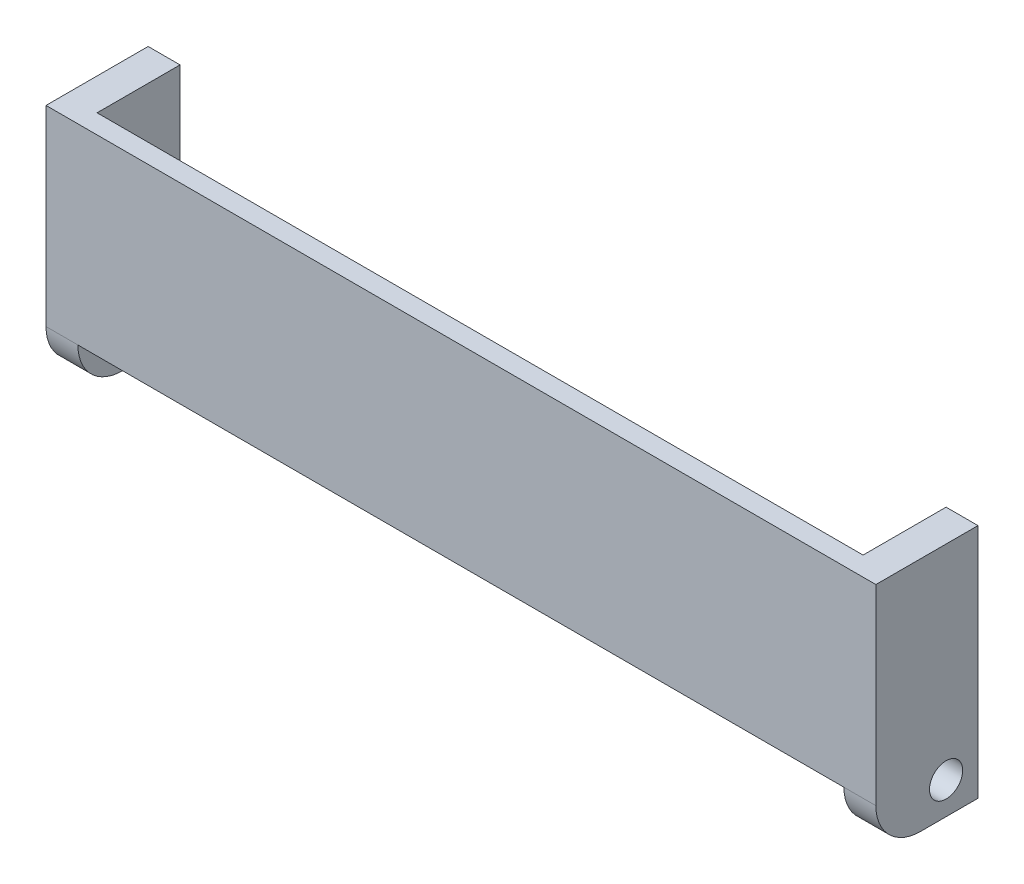
ISO-10303-21;
HEADER;
FILE_DESCRIPTION(('STEP AP214'),'2;1');
FILE_NAME('part.step','',(''),(''),'','','');
FILE_SCHEMA(('AUTOMOTIVE_DESIGN { 1 0 10303 214 1 1 1 1 }'));
ENDSEC;
DATA;
#1=APPLICATION_CONTEXT('core data for automotive mechanical design processes');
#2=APPLICATION_PROTOCOL_DEFINITION('international standard','automotive_design',2000,#1);
#3=PRODUCT_CONTEXT('',#1,'mechanical');
#4=PRODUCT('Part','Part','',(#3));
#5=PRODUCT_RELATED_PRODUCT_CATEGORY('part','',(#4));
#6=PRODUCT_DEFINITION_FORMATION('','',#4);
#7=PRODUCT_DEFINITION_CONTEXT('part definition',#1,'design');
#8=PRODUCT_DEFINITION('design','',#6,#7);
#9=PRODUCT_DEFINITION_SHAPE('','',#8);
#10=(LENGTH_UNIT() NAMED_UNIT(*) SI_UNIT(.MILLI.,.METRE.));
#11=(NAMED_UNIT(*) PLANE_ANGLE_UNIT() SI_UNIT($,.RADIAN.));
#12=(NAMED_UNIT(*) SI_UNIT($,.STERADIAN.) SOLID_ANGLE_UNIT());
#13=UNCERTAINTY_MEASURE_WITH_UNIT(LENGTH_MEASURE(1.E-05),#10,'distance_accuracy_value','');
#14=(GEOMETRIC_REPRESENTATION_CONTEXT(3) GLOBAL_UNCERTAINTY_ASSIGNED_CONTEXT((#13)) GLOBAL_UNIT_ASSIGNED_CONTEXT((#10,
#11,#12)) REPRESENTATION_CONTEXT('',''));
#15=CARTESIAN_POINT('',(0.,0.,0.));
#16=DIRECTION('',(0.,0.,1.));
#17=DIRECTION('',(1.,0.,0.));
#18=AXIS2_PLACEMENT_3D('',#15,#16,#17);
#19=CARTESIAN_POINT('',(0.,0.,10.));
#20=DIRECTION('',(1.,0.,0.));
#21=DIRECTION('',(0.,1.,0.));
#22=AXIS2_PLACEMENT_3D('',#19,#20,#21);
#23=PLANE('',#22);
#24=CARTESIAN_POINT('',(0.,-35.,5.));
#25=DIRECTION('',(1.,0.,0.));
#26=DIRECTION('',(0.,1.,0.));
#27=AXIS2_PLACEMENT_3D('',#24,#25,#26);
#28=CIRCLE('',#27,2.6);
#29=CARTESIAN_POINT('',(0.,-32.4,5.));
#30=VERTEX_POINT('',#29);
#31=EDGE_CURVE('E185',#30,#30,#28,.T.);
#32=ORIENTED_EDGE('',*,*,#31,.T.);
#33=EDGE_LOOP('',(#32));
#34=FACE_BOUND('',#33,.T.);
#35=DIRECTION('',(0.,0.,1.));
#36=VECTOR('',#35,1.);
#37=CARTESIAN_POINT('',(0.,-3.00000000000002,10.));
#38=LINE('',#37,#36);
#39=CARTESIAN_POINT('',(0.,-3.00000000000002,0.));
#40=VERTEX_POINT('',#39);
#41=CARTESIAN_POINT('',(0.,-3.00000000000002,13.));
#42=VERTEX_POINT('',#41);
#43=EDGE_CURVE('E247',#40,#42,#38,.T.);
#44=ORIENTED_EDGE('',*,*,#43,.F.);
#45=DIRECTION('',(0.,-1.,0.));
#46=VECTOR('',#45,1.);
#47=CARTESIAN_POINT('',(0.,0.,0.));
#48=LINE('',#47,#46);
#49=CARTESIAN_POINT('',(0.,-40.,0.));
#50=VERTEX_POINT('',#49);
#51=EDGE_CURVE('E188',#40,#50,#48,.T.);
#52=ORIENTED_EDGE('',*,*,#51,.T.);
#53=DIRECTION('',(0.,0.,-1.));
#54=VECTOR('',#53,1.);
#55=CARTESIAN_POINT('',(0.,-40.,10.));
#56=LINE('',#55,#54);
#57=CARTESIAN_POINT('',(0.,-40.,9.));
#58=VERTEX_POINT('',#57);
#59=EDGE_CURVE('E198',#58,#50,#56,.T.);
#60=ORIENTED_EDGE('',*,*,#59,.F.);
#61=CARTESIAN_POINT('',(0.,-33.,9.));
#62=DIRECTION('',(1.,0.,0.));
#63=DIRECTION('',(0.,1.,0.));
#64=AXIS2_PLACEMENT_3D('',#61,#62,#63);
#65=CIRCLE('',#64,7.);
#66=CARTESIAN_POINT('',(0.,-33.,16.));
#67=VERTEX_POINT('',#66);
#68=EDGE_CURVE('E11',#58,#67,#65,.F.);
#69=ORIENTED_EDGE('',*,*,#68,.T.);
#70=DIRECTION('',(0.,0.,1.));
#71=VECTOR('',#70,1.);
#72=CARTESIAN_POINT('',(0.,-33.,16.));
#73=LINE('',#72,#71);
#74=CARTESIAN_POINT('',(0.,-33.,13.));
#75=VERTEX_POINT('',#74);
#76=EDGE_CURVE('E167',#75,#67,#73,.T.);
#77=ORIENTED_EDGE('',*,*,#76,.F.);
#78=DIRECTION('',(0.,-1.,0.));
#79=VECTOR('',#78,1.);
#80=CARTESIAN_POINT('',(0.,-33.,13.));
#81=LINE('',#80,#79);
#82=EDGE_CURVE('E163',#42,#75,#81,.T.);
#83=ORIENTED_EDGE('',*,*,#82,.F.);
#84=EDGE_LOOP('',(#44,#52,#60,#69,#77,#83));
#85=FACE_BOUND('',#84,.T.);
#86=ADVANCED_FACE('F37',(#34,#85),#23,.F.);
#87=CARTESIAN_POINT('',(5.,0.,10.));
#88=DIRECTION('',(-1.,0.,0.));
#89=DIRECTION('',(0.,-1.,0.));
#90=AXIS2_PLACEMENT_3D('',#87,#88,#89);
#91=PLANE('',#90);
#92=CARTESIAN_POINT('',(5.,-35.,5.));
#93=DIRECTION('',(1.,0.,0.));
#94=DIRECTION('',(0.,1.,0.));
#95=AXIS2_PLACEMENT_3D('',#92,#93,#94);
#96=CIRCLE('',#95,2.6);
#97=CARTESIAN_POINT('',(5.,-32.4,5.));
#98=VERTEX_POINT('',#97);
#99=EDGE_CURVE('E182',#98,#98,#96,.T.);
#100=ORIENTED_EDGE('',*,*,#99,.F.);
#101=EDGE_LOOP('',(#100));
#102=FACE_BOUND('',#101,.T.);
#103=DIRECTION('',(0.,0.,-1.));
#104=VECTOR('',#103,1.);
#105=CARTESIAN_POINT('',(5.00000000000001,-3.00000000000002,20.));
#106=LINE('',#105,#104);
#107=CARTESIAN_POINT('',(5.00000000000001,-3.00000000000002,16.));
#108=VERTEX_POINT('',#107);
#109=CARTESIAN_POINT('',(5.00000000000001,-3.00000000000002,0.));
#110=VERTEX_POINT('',#109);
#111=EDGE_CURVE('E125',#108,#110,#106,.T.);
#112=ORIENTED_EDGE('',*,*,#111,.F.);
#113=DIRECTION('',(0.,1.,0.));
#114=VECTOR('',#113,1.);
#115=CARTESIAN_POINT('',(5.00000000000001,0.,16.));
#116=LINE('',#115,#114);
#117=CARTESIAN_POINT('',(5.00000000000001,-33.,16.));
#118=VERTEX_POINT('',#117);
#119=EDGE_CURVE('E179',#118,#108,#116,.T.);
#120=ORIENTED_EDGE('',*,*,#119,.F.);
#121=CARTESIAN_POINT('',(5.,-33.,9.));
#122=DIRECTION('',(-1.,0.,0.));
#123=DIRECTION('',(0.,-1.,0.));
#124=AXIS2_PLACEMENT_3D('',#121,#122,#123);
#125=CIRCLE('',#124,7.);
#126=CARTESIAN_POINT('',(5.00000000000001,-40.,9.));
#127=VERTEX_POINT('',#126);
#128=EDGE_CURVE('E203',#118,#127,#125,.F.);
#129=ORIENTED_EDGE('',*,*,#128,.T.);
#130=DIRECTION('',(0.,0.,-1.));
#131=VECTOR('',#130,1.);
#132=CARTESIAN_POINT('',(5.00000000000001,-40.,10.));
#133=LINE('',#132,#131);
#134=CARTESIAN_POINT('',(5.00000000000001,-40.,0.));
#135=VERTEX_POINT('',#134);
#136=EDGE_CURVE('E196',#127,#135,#133,.T.);
#137=ORIENTED_EDGE('',*,*,#136,.T.);
#138=DIRECTION('',(0.,1.,0.));
#139=VECTOR('',#138,1.);
#140=CARTESIAN_POINT('',(5.,0.,0.));
#141=LINE('',#140,#139);
#142=EDGE_CURVE('E193',#135,#110,#141,.T.);
#143=ORIENTED_EDGE('',*,*,#142,.T.);
#144=EDGE_LOOP('',(#112,#120,#129,#137,#143));
#145=FACE_BOUND('',#144,.T.);
#146=ADVANCED_FACE('F207',(#102,#145),#91,.F.);
#147=CARTESIAN_POINT('',(0.,0.,0.));
#148=DIRECTION('',(0.,0.,1.));
#149=DIRECTION('',(1.,0.,0.));
#150=AXIS2_PLACEMENT_3D('',#147,#148,#149);
#151=PLANE('',#150);
#152=DIRECTION('',(1.,0.,0.));
#153=VECTOR('',#152,1.);
#154=CARTESIAN_POINT('',(-125.,-3.00000000000002,0.));
#155=LINE('',#154,#153);
#156=EDGE_CURVE('E126',#40,#110,#155,.T.);
#157=ORIENTED_EDGE('',*,*,#156,.T.);
#158=ORIENTED_EDGE('',*,*,#142,.F.);
#159=DIRECTION('',(1.,0.,0.));
#160=VECTOR('',#159,1.);
#161=CARTESIAN_POINT('',(0.,-40.,0.));
#162=LINE('',#161,#160);
#163=EDGE_CURVE('E190',#50,#135,#162,.T.);
#164=ORIENTED_EDGE('',*,*,#163,.F.);
#165=ORIENTED_EDGE('',*,*,#51,.F.);
#166=EDGE_LOOP('',(#157,#158,#164,#165));
#167=FACE_BOUND('',#166,.T.);
#168=ADVANCED_FACE('F221',(#167),#151,.F.);
#169=CARTESIAN_POINT('',(0.,0.,16.));
#170=DIRECTION('',(0.,0.,1.));
#171=DIRECTION('',(1.,0.,0.));
#172=AXIS2_PLACEMENT_3D('',#169,#170,#171);
#173=PLANE('',#172);
#174=ORIENTED_EDGE('',*,*,#119,.T.);
#175=DIRECTION('',(-1.,0.,0.));
#176=VECTOR('',#175,1.);
#177=CARTESIAN_POINT('',(0.,-3.00000000000002,16.));
#178=LINE('',#177,#176);
#179=CARTESIAN_POINT('',(-125.,-3.00000000000002,16.));
#180=VERTEX_POINT('',#179);
#181=EDGE_CURVE('E225',#108,#180,#178,.T.);
#182=ORIENTED_EDGE('',*,*,#181,.T.);
#183=DIRECTION('',(0.,1.,0.));
#184=VECTOR('',#183,1.);
#185=CARTESIAN_POINT('',(-125.,0.,16.));
#186=LINE('',#185,#184);
#187=CARTESIAN_POINT('',(-125.,-33.,16.));
#188=VERTEX_POINT('',#187);
#189=EDGE_CURVE('E134',#188,#180,#186,.T.);
#190=ORIENTED_EDGE('',*,*,#189,.F.);
#191=DIRECTION('',(1.,0.,0.));
#192=VECTOR('',#191,1.);
#193=CARTESIAN_POINT('',(-125.,-33.,16.));
#194=LINE('',#193,#192);
#195=CARTESIAN_POINT('',(-120.,-33.,16.));
#196=VERTEX_POINT('',#195);
#197=EDGE_CURVE('E149',#188,#196,#194,.T.);
#198=ORIENTED_EDGE('',*,*,#197,.T.);
#199=DIRECTION('',(1.,0.,0.));
#200=VECTOR('',#199,1.);
#201=CARTESIAN_POINT('',(-120.,-33.,16.));
#202=LINE('',#201,#200);
#203=EDGE_CURVE('E170',#196,#67,#202,.T.);
#204=ORIENTED_EDGE('',*,*,#203,.T.);
#205=DIRECTION('',(1.,0.,0.));
#206=VECTOR('',#205,1.);
#207=CARTESIAN_POINT('',(5.00000000000001,-33.,16.));
#208=LINE('',#207,#206);
#209=EDGE_CURVE('E200',#67,#118,#208,.T.);
#210=ORIENTED_EDGE('',*,*,#209,.T.);
#211=EDGE_LOOP('',(#174,#182,#190,#198,#204,#210));
#212=FACE_BOUND('',#211,.T.);
#213=ADVANCED_FACE('F224',(#212),#173,.T.);
#214=CARTESIAN_POINT('',(-120.,-33.,13.));
#215=DIRECTION('',(0.,0.,1.));
#216=DIRECTION('',(1.,0.,0.));
#217=AXIS2_PLACEMENT_3D('',#214,#215,#216);
#218=PLANE('',#217);
#219=DIRECTION('',(-1.,0.,0.));
#220=VECTOR('',#219,1.);
#221=CARTESIAN_POINT('',(-120.,-3.00000000000002,13.));
#222=LINE('',#221,#220);
#223=CARTESIAN_POINT('',(-120.,-3.00000000000002,13.));
#224=VERTEX_POINT('',#223);
#225=EDGE_CURVE('E242',#42,#224,#222,.T.);
#226=ORIENTED_EDGE('',*,*,#225,.F.);
#227=ORIENTED_EDGE('',*,*,#82,.T.);
#228=DIRECTION('',(1.,0.,0.));
#229=VECTOR('',#228,1.);
#230=CARTESIAN_POINT('',(-120.,-33.,13.));
#231=LINE('',#230,#229);
#232=CARTESIAN_POINT('',(-120.,-33.,13.));
#233=VERTEX_POINT('',#232);
#234=EDGE_CURVE('E176',#233,#75,#231,.T.);
#235=ORIENTED_EDGE('',*,*,#234,.F.);
#236=DIRECTION('',(0.,-1.,0.));
#237=VECTOR('',#236,1.);
#238=CARTESIAN_POINT('',(-120.,-33.,13.));
#239=LINE('',#238,#237);
#240=EDGE_CURVE('E164',#224,#233,#239,.T.);
#241=ORIENTED_EDGE('',*,*,#240,.F.);
#242=EDGE_LOOP('',(#226,#227,#235,#241));
#243=FACE_BOUND('',#242,.T.);
#244=ADVANCED_FACE('F246',(#243),#218,.F.);
#245=CARTESIAN_POINT('',(-125.,-33.,9.));
#246=DIRECTION('',(1.,0.,0.));
#247=DIRECTION('',(0.,1.,0.));
#248=AXIS2_PLACEMENT_3D('',#245,#246,#247);
#249=PLANE('',#248);
#250=CARTESIAN_POINT('',(-125.,-35.,5.));
#251=DIRECTION('',(-1.,0.,0.));
#252=DIRECTION('',(0.,-1.,0.));
#253=AXIS2_PLACEMENT_3D('',#250,#251,#252);
#254=CIRCLE('',#253,2.6);
#255=CARTESIAN_POINT('',(-125.,-37.6,5.));
#256=VERTEX_POINT('',#255);
#257=EDGE_CURVE('E153',#256,#256,#254,.T.);
#258=ORIENTED_EDGE('',*,*,#257,.F.);
#259=EDGE_LOOP('',(#258));
#260=FACE_BOUND('',#259,.T.);
#261=DIRECTION('',(0.,0.,-1.));
#262=VECTOR('',#261,1.);
#263=CARTESIAN_POINT('',(-125.,-3.00000000000002,20.));
#264=LINE('',#263,#262);
#265=CARTESIAN_POINT('',(-125.,-3.00000000000002,0.));
#266=VERTEX_POINT('',#265);
#267=EDGE_CURVE('E120',#180,#266,#264,.T.);
#268=ORIENTED_EDGE('',*,*,#267,.T.);
#269=DIRECTION('',(0.,-1.,0.));
#270=VECTOR('',#269,1.);
#271=CARTESIAN_POINT('',(-125.,0.,0.));
#272=LINE('',#271,#270);
#273=CARTESIAN_POINT('',(-125.,-40.,0.));
#274=VERTEX_POINT('',#273);
#275=EDGE_CURVE('E131',#266,#274,#272,.T.);
#276=ORIENTED_EDGE('',*,*,#275,.T.);
#277=DIRECTION('',(0.,0.,1.));
#278=VECTOR('',#277,1.);
#279=CARTESIAN_POINT('',(-125.,-40.,0.));
#280=LINE('',#279,#278);
#281=CARTESIAN_POINT('',(-125.,-40.,9.));
#282=VERTEX_POINT('',#281);
#283=EDGE_CURVE('E140',#274,#282,#280,.T.);
#284=ORIENTED_EDGE('',*,*,#283,.T.);
#285=CARTESIAN_POINT('',(-125.,-33.,9.));
#286=DIRECTION('',(-1.,0.,0.));
#287=DIRECTION('',(0.,1.,0.));
#288=AXIS2_PLACEMENT_3D('',#285,#286,#287);
#289=CIRCLE('',#288,7.);
#290=EDGE_CURVE('E142',#282,#188,#289,.T.);
#291=ORIENTED_EDGE('',*,*,#290,.T.);
#292=ORIENTED_EDGE('',*,*,#189,.T.);
#293=EDGE_LOOP('',(#268,#276,#284,#291,#292));
#294=FACE_BOUND('',#293,.T.);
#295=ADVANCED_FACE('F130',(#260,#294),#249,.F.);
#296=CARTESIAN_POINT('',(-120.,-33.,9.));
#297=DIRECTION('',(1.,0.,0.));
#298=DIRECTION('',(0.,1.,0.));
#299=AXIS2_PLACEMENT_3D('',#296,#297,#298);
#300=PLANE('',#299);
#301=CARTESIAN_POINT('',(-120.,-35.,5.));
#302=DIRECTION('',(-1.,0.,0.));
#303=DIRECTION('',(0.,-1.,0.));
#304=AXIS2_PLACEMENT_3D('',#301,#302,#303);
#305=CIRCLE('',#304,2.6);
#306=CARTESIAN_POINT('',(-120.,-37.6,5.));
#307=VERTEX_POINT('',#306);
#308=EDGE_CURVE('E249',#307,#307,#305,.T.);
#309=ORIENTED_EDGE('',*,*,#308,.T.);
#310=EDGE_LOOP('',(#309));
#311=FACE_BOUND('',#310,.T.);
#312=DIRECTION('',(0.,-1.,0.));
#313=VECTOR('',#312,1.);
#314=CARTESIAN_POINT('',(-120.,0.,0.));
#315=LINE('',#314,#313);
#316=CARTESIAN_POINT('',(-120.,-3.00000000000002,0.));
#317=VERTEX_POINT('',#316);
#318=CARTESIAN_POINT('',(-120.,-40.,0.));
#319=VERTEX_POINT('',#318);
#320=EDGE_CURVE('E150',#317,#319,#315,.T.);
#321=ORIENTED_EDGE('',*,*,#320,.F.);
#322=DIRECTION('',(0.,0.,1.));
#323=VECTOR('',#322,1.);
#324=CARTESIAN_POINT('',(-120.,-3.00000000000002,9.));
#325=LINE('',#324,#323);
#326=EDGE_CURVE('E52',#317,#224,#325,.T.);
#327=ORIENTED_EDGE('',*,*,#326,.T.);
#328=ORIENTED_EDGE('',*,*,#240,.T.);
#329=DIRECTION('',(0.,0.,1.));
#330=VECTOR('',#329,1.);
#331=CARTESIAN_POINT('',(-120.,-33.,16.));
#332=LINE('',#331,#330);
#333=EDGE_CURVE('E166',#233,#196,#332,.T.);
#334=ORIENTED_EDGE('',*,*,#333,.T.);
#335=CARTESIAN_POINT('',(-120.,-33.,9.));
#336=DIRECTION('',(-1.,0.,0.));
#337=DIRECTION('',(0.,1.,0.));
#338=AXIS2_PLACEMENT_3D('',#335,#336,#337);
#339=CIRCLE('',#338,7.);
#340=CARTESIAN_POINT('',(-120.,-40.,9.));
#341=VERTEX_POINT('',#340);
#342=EDGE_CURVE('E144',#341,#196,#339,.T.);
#343=ORIENTED_EDGE('',*,*,#342,.F.);
#344=DIRECTION('',(0.,0.,1.));
#345=VECTOR('',#344,1.);
#346=CARTESIAN_POINT('',(-120.,-40.,0.));
#347=LINE('',#346,#345);
#348=EDGE_CURVE('E152',#319,#341,#347,.T.);
#349=ORIENTED_EDGE('',*,*,#348,.F.);
#350=EDGE_LOOP('',(#321,#327,#328,#334,#343,#349));
#351=FACE_BOUND('',#350,.T.);
#352=ADVANCED_FACE('F232',(#311,#351),#300,.T.);
#353=CARTESIAN_POINT('',(-125.,0.,0.));
#354=DIRECTION('',(0.,0.,1.));
#355=DIRECTION('',(1.,0.,0.));
#356=AXIS2_PLACEMENT_3D('',#353,#354,#355);
#357=PLANE('',#356);
#358=EDGE_CURVE('E117',#266,#317,#155,.T.);
#359=ORIENTED_EDGE('',*,*,#358,.T.);
#360=ORIENTED_EDGE('',*,*,#320,.T.);
#361=DIRECTION('',(1.,0.,0.));
#362=VECTOR('',#361,1.);
#363=CARTESIAN_POINT('',(-125.,-40.,0.));
#364=LINE('',#363,#362);
#365=EDGE_CURVE('E138',#274,#319,#364,.T.);
#366=ORIENTED_EDGE('',*,*,#365,.F.);
#367=ORIENTED_EDGE('',*,*,#275,.F.);
#368=EDGE_LOOP('',(#359,#360,#366,#367));
#369=FACE_BOUND('',#368,.T.);
#370=ADVANCED_FACE('F136',(#369),#357,.F.);
#371=CARTESIAN_POINT('',(0.,-40.,10.));
#372=DIRECTION('',(0.,1.,0.));
#373=DIRECTION('',(0.,0.,1.));
#374=AXIS2_PLACEMENT_3D('',#371,#372,#373);
#375=PLANE('',#374);
#376=ORIENTED_EDGE('',*,*,#136,.F.);
#377=DIRECTION('',(1.,0.,0.));
#378=VECTOR('',#377,1.);
#379=CARTESIAN_POINT('',(0.,-40.,9.));
#380=LINE('',#379,#378);
#381=EDGE_CURVE('E45',#127,#58,#380,.F.);
#382=ORIENTED_EDGE('',*,*,#381,.T.);
#383=ORIENTED_EDGE('',*,*,#59,.T.);
#384=ORIENTED_EDGE('',*,*,#163,.T.);
#385=EDGE_LOOP('',(#376,#382,#383,#384));
#386=FACE_BOUND('',#385,.T.);
#387=ADVANCED_FACE('F210',(#386),#375,.F.);
#388=CARTESIAN_POINT('',(-5.,-35.,5.));
#389=DIRECTION('',(1.,0.,0.));
#390=DIRECTION('',(0.,1.,0.));
#391=AXIS2_PLACEMENT_3D('',#388,#389,#390);
#392=CYLINDRICAL_SURFACE('',#391,2.6);
#393=ORIENTED_EDGE('',*,*,#99,.T.);
#394=EDGE_LOOP('',(#393));
#395=FACE_BOUND('',#394,.T.);
#396=ORIENTED_EDGE('',*,*,#31,.F.);
#397=EDGE_LOOP('',(#396));
#398=FACE_BOUND('',#397,.T.);
#399=ADVANCED_FACE('F278',(#395,#398),#392,.F.);
#400=CARTESIAN_POINT('',(0.,-33.,9.));
#401=DIRECTION('',(-1.,0.,0.));
#402=DIRECTION('',(0.,0.,1.));
#403=AXIS2_PLACEMENT_3D('',#400,#401,#402);
#404=CYLINDRICAL_SURFACE('',#403,7.);
#405=ORIENTED_EDGE('',*,*,#68,.F.);
#406=ORIENTED_EDGE('',*,*,#381,.F.);
#407=ORIENTED_EDGE('',*,*,#128,.F.);
#408=ORIENTED_EDGE('',*,*,#209,.F.);
#409=EDGE_LOOP('',(#405,#406,#407,#408));
#410=FACE_BOUND('',#409,.T.);
#411=ADVANCED_FACE('F39',(#410),#404,.T.);
#412=CARTESIAN_POINT('',(-120.,-33.,16.));
#413=DIRECTION('',(0.,1.,0.));
#414=DIRECTION('',(-1.,0.,0.));
#415=AXIS2_PLACEMENT_3D('',#412,#413,#414);
#416=PLANE('',#415);
#417=ORIENTED_EDGE('',*,*,#76,.T.);
#418=ORIENTED_EDGE('',*,*,#203,.F.);
#419=ORIENTED_EDGE('',*,*,#333,.F.);
#420=ORIENTED_EDGE('',*,*,#234,.T.);
#421=EDGE_LOOP('',(#417,#418,#419,#420));
#422=FACE_BOUND('',#421,.T.);
#423=ADVANCED_FACE('F229',(#422),#416,.F.);
#424=CARTESIAN_POINT('',(-125.,-40.,0.));
#425=DIRECTION('',(0.,1.,0.));
#426=DIRECTION('',(-1.,0.,0.));
#427=AXIS2_PLACEMENT_3D('',#424,#425,#426);
#428=PLANE('',#427);
#429=ORIENTED_EDGE('',*,*,#348,.T.);
#430=DIRECTION('',(1.,0.,0.));
#431=VECTOR('',#430,1.);
#432=CARTESIAN_POINT('',(-125.,-40.,9.));
#433=LINE('',#432,#431);
#434=EDGE_CURVE('E159',#282,#341,#433,.T.);
#435=ORIENTED_EDGE('',*,*,#434,.F.);
#436=ORIENTED_EDGE('',*,*,#283,.F.);
#437=ORIENTED_EDGE('',*,*,#365,.T.);
#438=EDGE_LOOP('',(#429,#435,#436,#437));
#439=FACE_BOUND('',#438,.T.);
#440=ADVANCED_FACE('F241',(#439),#428,.F.);
#441=CARTESIAN_POINT('',(-125.,-33.,9.));
#442=DIRECTION('',(1.,0.,0.));
#443=DIRECTION('',(0.,1.,0.));
#444=AXIS2_PLACEMENT_3D('',#441,#442,#443);
#445=CYLINDRICAL_SURFACE('',#444,7.);
#446=ORIENTED_EDGE('',*,*,#342,.T.);
#447=ORIENTED_EDGE('',*,*,#197,.F.);
#448=ORIENTED_EDGE('',*,*,#290,.F.);
#449=ORIENTED_EDGE('',*,*,#434,.T.);
#450=EDGE_LOOP('',(#446,#447,#448,#449));
#451=FACE_BOUND('',#450,.T.);
#452=ADVANCED_FACE('F237',(#451),#445,.T.);
#453=CARTESIAN_POINT('',(-125.,-35.,5.));
#454=DIRECTION('',(1.,0.,0.));
#455=DIRECTION('',(0.,1.,0.));
#456=AXIS2_PLACEMENT_3D('',#453,#454,#455);
#457=CYLINDRICAL_SURFACE('',#456,2.6);
#458=ORIENTED_EDGE('',*,*,#257,.T.);
#459=EDGE_LOOP('',(#458));
#460=FACE_BOUND('',#459,.T.);
#461=ORIENTED_EDGE('',*,*,#308,.F.);
#462=EDGE_LOOP('',(#461));
#463=FACE_BOUND('',#462,.T.);
#464=ADVANCED_FACE('F258',(#460,#463),#457,.F.);
#465=CARTESIAN_POINT('',(-125.,-3.00000000000002,20.));
#466=DIRECTION('',(0.,1.,0.));
#467=DIRECTION('',(-1.,0.,0.));
#468=AXIS2_PLACEMENT_3D('',#465,#466,#467);
#469=PLANE('',#468);
#470=ORIENTED_EDGE('',*,*,#111,.T.);
#471=ORIENTED_EDGE('',*,*,#156,.F.);
#472=ORIENTED_EDGE('',*,*,#43,.T.);
#473=ORIENTED_EDGE('',*,*,#225,.T.);
#474=ORIENTED_EDGE('',*,*,#326,.F.);
#475=ORIENTED_EDGE('',*,*,#358,.F.);
#476=ORIENTED_EDGE('',*,*,#267,.F.);
#477=ORIENTED_EDGE('',*,*,#181,.F.);
#478=EDGE_LOOP('',(#470,#471,#472,#473,#474,#475,#476,#477));
#479=FACE_BOUND('',#478,.T.);
#480=ADVANCED_FACE('F119',(#479),#469,.T.);
#481=CLOSED_SHELL('',(#86,#146,#168,#213,#244,#295,#352,#370,#387,#399,#411,#423,#440,#452,#464,#480));
#482=MANIFOLD_SOLID_BREP('B2',#481);
#483=ADVANCED_BREP_SHAPE_REPRESENTATION('',(#18,#482),#14);
#484=SHAPE_DEFINITION_REPRESENTATION(#9,#483);
ENDSEC;
END-ISO-10303-21;
